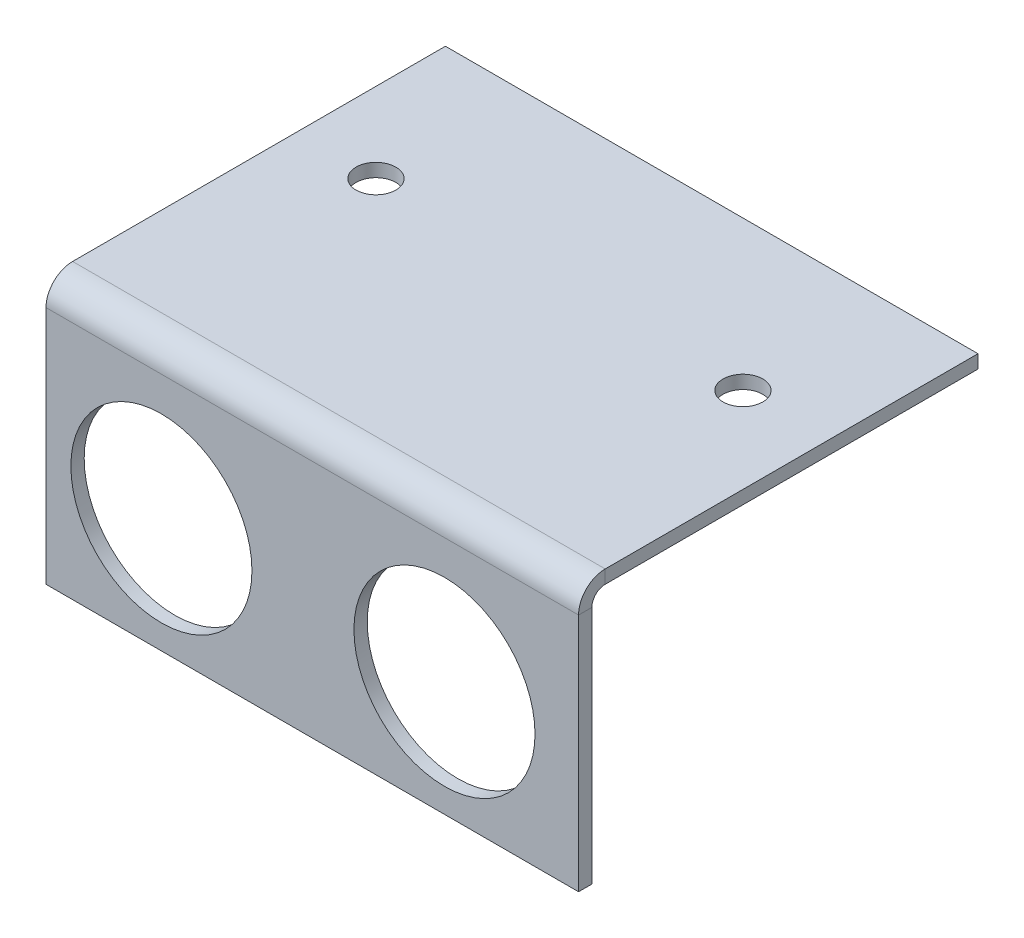
ISO-10303-21;
HEADER;
FILE_DESCRIPTION(('STEP AP214'),'2;1');
FILE_NAME('part.step','',(''),(''),'','','');
FILE_SCHEMA(('AUTOMOTIVE_DESIGN { 1 0 10303 214 1 1 1 1 }'));
ENDSEC;
DATA;
#1=APPLICATION_CONTEXT('core data for automotive mechanical design processes');
#2=APPLICATION_PROTOCOL_DEFINITION('international standard','automotive_design',2000,#1);
#3=PRODUCT_CONTEXT('',#1,'mechanical');
#4=PRODUCT('Part','Part','',(#3));
#5=PRODUCT_RELATED_PRODUCT_CATEGORY('part','',(#4));
#6=PRODUCT_DEFINITION_FORMATION('','',#4);
#7=PRODUCT_DEFINITION_CONTEXT('part definition',#1,'design');
#8=PRODUCT_DEFINITION('design','',#6,#7);
#9=PRODUCT_DEFINITION_SHAPE('','',#8);
#10=(LENGTH_UNIT() NAMED_UNIT(*) SI_UNIT(.MILLI.,.METRE.));
#11=(NAMED_UNIT(*) PLANE_ANGLE_UNIT() SI_UNIT($,.RADIAN.));
#12=(NAMED_UNIT(*) SI_UNIT($,.STERADIAN.) SOLID_ANGLE_UNIT());
#13=UNCERTAINTY_MEASURE_WITH_UNIT(LENGTH_MEASURE(1.E-05),#10,'distance_accuracy_value','');
#14=(GEOMETRIC_REPRESENTATION_CONTEXT(3) GLOBAL_UNCERTAINTY_ASSIGNED_CONTEXT((#13)) GLOBAL_UNIT_ASSIGNED_CONTEXT((#10,
#11,#12)) REPRESENTATION_CONTEXT('',''));
#15=CARTESIAN_POINT('',(0.,0.,0.));
#16=DIRECTION('',(0.,0.,1.));
#17=DIRECTION('',(1.,0.,0.));
#18=AXIS2_PLACEMENT_3D('',#15,#16,#17);
#19=CARTESIAN_POINT('',(-25.0613809960493,-3.6117945370641,-63.543927144697));
#20=DIRECTION('',(-1.,0.,0.));
#21=DIRECTION('',(0.,1.,0.));
#22=AXIS2_PLACEMENT_3D('',#19,#20,#21);
#23=PLANE('',#22);
#24=DIRECTION('',(0.,0.,-1.));
#25=VECTOR('',#24,1.);
#26=CARTESIAN_POINT('',(-25.0613809960493,19.2482054629359,-63.543927144697));
#27=LINE('',#26,#25);
#28=CARTESIAN_POINT('',(-25.0613809960493,19.2482054629359,-62.273927144697));
#29=VERTEX_POINT('',#28);
#30=CARTESIAN_POINT('',(-25.0613809960493,19.2482054629359,-63.543927144697));
#31=VERTEX_POINT('',#30);
#32=EDGE_CURVE('E11',#29,#31,#27,.T.);
#33=ORIENTED_EDGE('',*,*,#32,.F.);
#34=DIRECTION('',(0.,1.,0.));
#35=VECTOR('',#34,1.);
#36=CARTESIAN_POINT('',(-25.0613809960493,-3.6117945370641,-62.273927144697));
#37=LINE('',#36,#35);
#38=CARTESIAN_POINT('',(-25.0613809960493,-3.6117945370641,-62.273927144697));
#39=VERTEX_POINT('',#38);
#40=EDGE_CURVE('E89',#39,#29,#37,.T.);
#41=ORIENTED_EDGE('',*,*,#40,.F.);
#42=DIRECTION('',(0.,0.,-1.));
#43=VECTOR('',#42,1.);
#44=CARTESIAN_POINT('',(-25.0613809960493,-3.6117945370641,-63.543927144697));
#45=LINE('',#44,#43);
#46=CARTESIAN_POINT('',(-25.0613809960493,-3.6117945370641,-63.543927144697));
#47=VERTEX_POINT('',#46);
#48=EDGE_CURVE('E49',#39,#47,#45,.T.);
#49=ORIENTED_EDGE('',*,*,#48,.T.);
#50=DIRECTION('',(0.,1.,0.));
#51=VECTOR('',#50,1.);
#52=CARTESIAN_POINT('',(-25.0613809960493,-3.6117945370641,-63.543927144697));
#53=LINE('',#52,#51);
#54=EDGE_CURVE('E92',#47,#31,#53,.T.);
#55=ORIENTED_EDGE('',*,*,#54,.T.);
#56=EDGE_LOOP('',(#33,#41,#49,#55));
#57=FACE_BOUND('',#56,.T.);
#58=ADVANCED_FACE('F39',(#57),#23,.F.);
#59=CARTESIAN_POINT('',(-75.8613809960492,-3.6117945370641,-63.543927144697));
#60=DIRECTION('',(0.,1.,0.));
#61=DIRECTION('',(1.,0.,0.));
#62=AXIS2_PLACEMENT_3D('',#59,#60,#61);
#63=PLANE('',#62);
#64=ORIENTED_EDGE('',*,*,#48,.F.);
#65=DIRECTION('',(-1.,0.,0.));
#66=VECTOR('',#65,1.);
#67=CARTESIAN_POINT('',(-75.8613809960492,-3.6117945370641,-62.273927144697));
#68=LINE('',#67,#66);
#69=CARTESIAN_POINT('',(-75.8613809960492,-3.6117945370641,-62.273927144697));
#70=VERTEX_POINT('',#69);
#71=EDGE_CURVE('E117',#70,#39,#68,.F.);
#72=ORIENTED_EDGE('',*,*,#71,.F.);
#73=DIRECTION('',(0.,0.,-1.));
#74=VECTOR('',#73,1.);
#75=CARTESIAN_POINT('',(-75.8613809960492,-3.6117945370641,-63.543927144697));
#76=LINE('',#75,#74);
#77=CARTESIAN_POINT('',(-75.8613809960492,-3.6117945370641,-63.543927144697));
#78=VERTEX_POINT('',#77);
#79=EDGE_CURVE('E146',#70,#78,#76,.T.);
#80=ORIENTED_EDGE('',*,*,#79,.T.);
#81=DIRECTION('',(1.,0.,0.));
#82=VECTOR('',#81,1.);
#83=CARTESIAN_POINT('',(-75.8613809960492,-3.6117945370641,-63.543927144697));
#84=LINE('',#83,#82);
#85=EDGE_CURVE('E157',#78,#47,#84,.T.);
#86=ORIENTED_EDGE('',*,*,#85,.T.);
#87=EDGE_LOOP('',(#64,#72,#80,#86));
#88=FACE_BOUND('',#87,.T.);
#89=ADVANCED_FACE('F163',(#88),#63,.F.);
#90=CARTESIAN_POINT('',(-75.8613809960492,-3.6117945370641,-63.543927144697));
#91=DIRECTION('',(-1.,0.,0.));
#92=DIRECTION('',(0.,1.,0.));
#93=AXIS2_PLACEMENT_3D('',#90,#91,#92);
#94=PLANE('',#93);
#95=ORIENTED_EDGE('',*,*,#79,.F.);
#96=DIRECTION('',(0.,1.,0.));
#97=VECTOR('',#96,1.);
#98=CARTESIAN_POINT('',(-75.8613809960492,-3.6117945370641,-62.273927144697));
#99=LINE('',#98,#97);
#100=CARTESIAN_POINT('',(-75.8613809960492,19.2482054629359,-62.273927144697));
#101=VERTEX_POINT('',#100);
#102=EDGE_CURVE('E192',#70,#101,#99,.T.);
#103=ORIENTED_EDGE('',*,*,#102,.T.);
#104=DIRECTION('',(0.,0.,-1.));
#105=VECTOR('',#104,1.);
#106=CARTESIAN_POINT('',(-75.8613809960492,19.2482054629359,-63.543927144697));
#107=LINE('',#106,#105);
#108=CARTESIAN_POINT('',(-75.8613809960492,19.2482054629359,-63.543927144697));
#109=VERTEX_POINT('',#108);
#110=EDGE_CURVE('E143',#101,#109,#107,.T.);
#111=ORIENTED_EDGE('',*,*,#110,.T.);
#112=DIRECTION('',(0.,1.,0.));
#113=VECTOR('',#112,1.);
#114=CARTESIAN_POINT('',(-75.8613809960492,-3.6117945370641,-63.543927144697));
#115=LINE('',#114,#113);
#116=EDGE_CURVE('E164',#78,#109,#115,.T.);
#117=ORIENTED_EDGE('',*,*,#116,.F.);
#118=EDGE_LOOP('',(#95,#103,#111,#117));
#119=FACE_BOUND('',#118,.T.);
#120=ADVANCED_FACE('F198',(#119),#94,.T.);
#121=CARTESIAN_POINT('',(-75.8613809960492,19.2482054629359,-64.813927144697));
#122=DIRECTION('',(-1.,0.,0.));
#123=DIRECTION('',(0.,0.,1.));
#124=AXIS2_PLACEMENT_3D('',#121,#122,#123);
#125=PLANE('',#124);
#126=ORIENTED_EDGE('',*,*,#110,.F.);
#127=CARTESIAN_POINT('',(-75.8613809960492,19.2482054629359,-64.813927144697));
#128=DIRECTION('',(-1.,0.,0.));
#129=DIRECTION('',(0.,0.,1.));
#130=AXIS2_PLACEMENT_3D('',#127,#128,#129);
#131=CIRCLE('',#130,2.54);
#132=CARTESIAN_POINT('',(-75.8613809960492,21.7882054629359,-64.813927144697));
#133=VERTEX_POINT('',#132);
#134=EDGE_CURVE('E107',#101,#133,#131,.T.);
#135=ORIENTED_EDGE('',*,*,#134,.T.);
#136=DIRECTION('',(0.,-1.,0.));
#137=VECTOR('',#136,1.);
#138=CARTESIAN_POINT('',(-75.8613809960492,20.5182054629359,-64.813927144697));
#139=LINE('',#138,#137);
#140=CARTESIAN_POINT('',(-75.8613809960492,20.5182054629359,-64.813927144697));
#141=VERTEX_POINT('',#140);
#142=EDGE_CURVE('E57',#133,#141,#139,.T.);
#143=ORIENTED_EDGE('',*,*,#142,.T.);
#144=CARTESIAN_POINT('',(-75.8613809960492,19.2482054629359,-64.813927144697));
#145=DIRECTION('',(1.,0.,0.));
#146=DIRECTION('',(0.,0.,-1.));
#147=AXIS2_PLACEMENT_3D('',#144,#145,#146);
#148=CIRCLE('',#147,1.27);
#149=EDGE_CURVE('E184',#109,#141,#148,.F.);
#150=ORIENTED_EDGE('',*,*,#149,.F.);
#151=EDGE_LOOP('',(#126,#135,#143,#150));
#152=FACE_BOUND('',#151,.T.);
#153=ADVANCED_FACE('F201',(#152),#125,.T.);
#154=CARTESIAN_POINT('',(-75.8613809960492,20.5182054629359,-63.543927144697));
#155=DIRECTION('',(-1.,0.,0.));
#156=DIRECTION('',(0.,0.,-1.));
#157=AXIS2_PLACEMENT_3D('',#154,#155,#156);
#158=PLANE('',#157);
#159=ORIENTED_EDGE('',*,*,#142,.F.);
#160=DIRECTION('',(0.,0.,-1.));
#161=VECTOR('',#160,1.);
#162=CARTESIAN_POINT('',(-75.8613809960492,21.7882054629359,-63.543927144697));
#163=LINE('',#162,#161);
#164=CARTESIAN_POINT('',(-75.8613809960492,21.7882054629359,-100.373927144697));
#165=VERTEX_POINT('',#164);
#166=EDGE_CURVE('E191',#133,#165,#163,.T.);
#167=ORIENTED_EDGE('',*,*,#166,.T.);
#168=DIRECTION('',(0.,-1.,0.));
#169=VECTOR('',#168,1.);
#170=CARTESIAN_POINT('',(-75.8613809960492,20.5182054629359,-100.373927144697));
#171=LINE('',#170,#169);
#172=CARTESIAN_POINT('',(-75.8613809960492,20.5182054629359,-100.373927144697));
#173=VERTEX_POINT('',#172);
#174=EDGE_CURVE('E139',#165,#173,#171,.T.);
#175=ORIENTED_EDGE('',*,*,#174,.T.);
#176=DIRECTION('',(0.,0.,-1.));
#177=VECTOR('',#176,1.);
#178=CARTESIAN_POINT('',(-75.8613809960492,20.5182054629359,-63.543927144697));
#179=LINE('',#178,#177);
#180=EDGE_CURVE('E172',#141,#173,#179,.T.);
#181=ORIENTED_EDGE('',*,*,#180,.F.);
#182=EDGE_LOOP('',(#159,#167,#175,#181));
#183=FACE_BOUND('',#182,.T.);
#184=ADVANCED_FACE('F211',(#183),#158,.T.);
#185=CARTESIAN_POINT('',(-75.8613809960492,20.5182054629359,-100.373927144697));
#186=DIRECTION('',(0.,0.,-1.));
#187=DIRECTION('',(1.,0.,0.));
#188=AXIS2_PLACEMENT_3D('',#185,#186,#187);
#189=PLANE('',#188);
#190=ORIENTED_EDGE('',*,*,#174,.F.);
#191=DIRECTION('',(1.,0.,0.));
#192=VECTOR('',#191,1.);
#193=CARTESIAN_POINT('',(-75.8613809960492,21.7882054629359,-100.373927144697));
#194=LINE('',#193,#192);
#195=CARTESIAN_POINT('',(-25.0613809960493,21.7882054629359,-100.373927144697));
#196=VERTEX_POINT('',#195);
#197=EDGE_CURVE('E112',#165,#196,#194,.T.);
#198=ORIENTED_EDGE('',*,*,#197,.T.);
#199=DIRECTION('',(0.,-1.,0.));
#200=VECTOR('',#199,1.);
#201=CARTESIAN_POINT('',(-25.0613809960493,20.5182054629359,-100.373927144697));
#202=LINE('',#201,#200);
#203=CARTESIAN_POINT('',(-25.0613809960493,20.5182054629359,-100.373927144697));
#204=VERTEX_POINT('',#203);
#205=EDGE_CURVE('E136',#196,#204,#202,.T.);
#206=ORIENTED_EDGE('',*,*,#205,.T.);
#207=DIRECTION('',(1.,0.,0.));
#208=VECTOR('',#207,1.);
#209=CARTESIAN_POINT('',(-75.8613809960492,20.5182054629359,-100.373927144697));
#210=LINE('',#209,#208);
#211=EDGE_CURVE('E175',#173,#204,#210,.T.);
#212=ORIENTED_EDGE('',*,*,#211,.F.);
#213=EDGE_LOOP('',(#190,#198,#206,#212));
#214=FACE_BOUND('',#213,.T.);
#215=ADVANCED_FACE('F219',(#214),#189,.T.);
#216=CARTESIAN_POINT('',(-25.0613809960493,20.5182054629359,-63.543927144697));
#217=DIRECTION('',(-1.,0.,0.));
#218=DIRECTION('',(0.,0.,-1.));
#219=AXIS2_PLACEMENT_3D('',#216,#217,#218);
#220=PLANE('',#219);
#221=ORIENTED_EDGE('',*,*,#205,.F.);
#222=DIRECTION('',(0.,0.,-1.));
#223=VECTOR('',#222,1.);
#224=CARTESIAN_POINT('',(-25.0613809960493,21.7882054629359,-63.543927144697));
#225=LINE('',#224,#223);
#226=CARTESIAN_POINT('',(-25.0613809960493,21.7882054629359,-64.813927144697));
#227=VERTEX_POINT('',#226);
#228=EDGE_CURVE('E188',#227,#196,#225,.T.);
#229=ORIENTED_EDGE('',*,*,#228,.F.);
#230=DIRECTION('',(0.,-1.,0.));
#231=VECTOR('',#230,1.);
#232=CARTESIAN_POINT('',(-25.0613809960493,20.5182054629359,-64.813927144697));
#233=LINE('',#232,#231);
#234=CARTESIAN_POINT('',(-25.0613809960493,20.5182054629359,-64.813927144697));
#235=VERTEX_POINT('',#234);
#236=EDGE_CURVE('E43',#227,#235,#233,.T.);
#237=ORIENTED_EDGE('',*,*,#236,.T.);
#238=DIRECTION('',(0.,0.,-1.));
#239=VECTOR('',#238,1.);
#240=CARTESIAN_POINT('',(-25.0613809960493,20.5182054629359,-63.543927144697));
#241=LINE('',#240,#239);
#242=EDGE_CURVE('E166',#235,#204,#241,.T.);
#243=ORIENTED_EDGE('',*,*,#242,.T.);
#244=EDGE_LOOP('',(#221,#229,#237,#243));
#245=FACE_BOUND('',#244,.T.);
#246=ADVANCED_FACE('F221',(#245),#220,.F.);
#247=CARTESIAN_POINT('',(-37.852637296222,7.33859011790811,-63.543927144697));
#248=DIRECTION('',(0.,0.,-1.));
#249=DIRECTION('',(-1.,0.,0.));
#250=AXIS2_PLACEMENT_3D('',#247,#248,#249);
#251=CYLINDRICAL_SURFACE('',#250,8.636);
#252=CARTESIAN_POINT('',(-37.852637296222,7.33859011790811,-63.543927144697));
#253=DIRECTION('',(0.,0.,-1.));
#254=DIRECTION('',(-1.,0.,0.));
#255=AXIS2_PLACEMENT_3D('',#252,#253,#254);
#256=CIRCLE('',#255,8.636);
#257=CARTESIAN_POINT('',(-46.488637296222,7.33859011790811,-63.543927144697));
#258=VERTEX_POINT('',#257);
#259=EDGE_CURVE('E186',#258,#258,#256,.T.);
#260=ORIENTED_EDGE('',*,*,#259,.T.);
#261=EDGE_LOOP('',(#260));
#262=FACE_BOUND('',#261,.T.);
#263=CARTESIAN_POINT('',(-37.852637296222,7.33859011790811,-62.273927144697));
#264=DIRECTION('',(0.,0.,-1.));
#265=DIRECTION('',(-1.,0.,0.));
#266=AXIS2_PLACEMENT_3D('',#263,#264,#265);
#267=CIRCLE('',#266,8.636);
#268=CARTESIAN_POINT('',(-46.488637296222,7.33859011790811,-62.273927144697));
#269=VERTEX_POINT('',#268);
#270=EDGE_CURVE('E125',#269,#269,#267,.T.);
#271=ORIENTED_EDGE('',*,*,#270,.F.);
#272=EDGE_LOOP('',(#271));
#273=FACE_BOUND('',#272,.T.);
#274=ADVANCED_FACE('F245',(#262,#273),#251,.F.);
#275=CARTESIAN_POINT('',(-64.852637296222,7.33859011790812,-63.543927144697));
#276=DIRECTION('',(0.,0.,-1.));
#277=DIRECTION('',(-1.,0.,0.));
#278=AXIS2_PLACEMENT_3D('',#275,#276,#277);
#279=CYLINDRICAL_SURFACE('',#278,8.636);
#280=CARTESIAN_POINT('',(-64.852637296222,7.33859011790812,-63.543927144697));
#281=DIRECTION('',(0.,0.,-1.));
#282=DIRECTION('',(-1.,0.,0.));
#283=AXIS2_PLACEMENT_3D('',#280,#281,#282);
#284=CIRCLE('',#283,8.636);
#285=CARTESIAN_POINT('',(-73.488637296222,7.33859011790812,-63.543927144697));
#286=VERTEX_POINT('',#285);
#287=EDGE_CURVE('E161',#286,#286,#284,.T.);
#288=ORIENTED_EDGE('',*,*,#287,.T.);
#289=EDGE_LOOP('',(#288));
#290=FACE_BOUND('',#289,.T.);
#291=CARTESIAN_POINT('',(-64.852637296222,7.33859011790812,-62.273927144697));
#292=DIRECTION('',(0.,0.,-1.));
#293=DIRECTION('',(-1.,0.,0.));
#294=AXIS2_PLACEMENT_3D('',#291,#292,#293);
#295=CIRCLE('',#294,8.636);
#296=CARTESIAN_POINT('',(-73.488637296222,7.33859011790812,-62.273927144697));
#297=VERTEX_POINT('',#296);
#298=EDGE_CURVE('E118',#297,#297,#295,.T.);
#299=ORIENTED_EDGE('',*,*,#298,.F.);
#300=EDGE_LOOP('',(#299));
#301=FACE_BOUND('',#300,.T.);
#302=ADVANCED_FACE('F41',(#290,#301),#279,.F.);
#303=CARTESIAN_POINT('',(-25.0613809960493,19.2482054629359,-64.813927144697));
#304=DIRECTION('',(1.,0.,0.));
#305=DIRECTION('',(0.,0.,-1.));
#306=AXIS2_PLACEMENT_3D('',#303,#304,#305);
#307=PLANE('',#306);
#308=CARTESIAN_POINT('',(-25.0613809960493,19.2482054629359,-64.813927144697));
#309=DIRECTION('',(-1.,0.,0.));
#310=DIRECTION('',(0.,0.,1.));
#311=AXIS2_PLACEMENT_3D('',#308,#309,#310);
#312=CIRCLE('',#311,2.54);
#313=EDGE_CURVE('E105',#227,#29,#312,.F.);
#314=ORIENTED_EDGE('',*,*,#313,.T.);
#315=ORIENTED_EDGE('',*,*,#32,.T.);
#316=CARTESIAN_POINT('',(-25.0613809960493,19.2482054629359,-64.813927144697));
#317=DIRECTION('',(-1.,0.,0.));
#318=DIRECTION('',(0.,0.,1.));
#319=AXIS2_PLACEMENT_3D('',#316,#317,#318);
#320=CIRCLE('',#319,1.27);
#321=EDGE_CURVE('E182',#235,#31,#320,.F.);
#322=ORIENTED_EDGE('',*,*,#321,.F.);
#323=ORIENTED_EDGE('',*,*,#236,.F.);
#324=EDGE_LOOP('',(#314,#315,#322,#323));
#325=FACE_BOUND('',#324,.T.);
#326=ADVANCED_FACE('F121',(#325),#307,.T.);
#327=CARTESIAN_POINT('',(-75.8613809960492,20.5182054629359,-63.543927144697));
#328=DIRECTION('',(0.,-1.,0.));
#329=DIRECTION('',(0.,0.,-1.));
#330=AXIS2_PLACEMENT_3D('',#327,#328,#329);
#331=PLANE('',#330);
#332=CARTESIAN_POINT('',(-33.2366463921909,20.5182054629359,-86.1267751885231));
#333=DIRECTION('',(0.,-1.,0.));
#334=DIRECTION('',(0.,0.,-1.));
#335=AXIS2_PLACEMENT_3D('',#332,#333,#334);
#336=CIRCLE('',#335,1.89865);
#337=CARTESIAN_POINT('',(-33.2366463921909,20.5182054629359,-88.0254251885231));
#338=VERTEX_POINT('',#337);
#339=EDGE_CURVE('E268',#338,#338,#336,.T.);
#340=ORIENTED_EDGE('',*,*,#339,.F.);
#341=EDGE_LOOP('',(#340));
#342=FACE_BOUND('',#341,.T.);
#343=CARTESIAN_POINT('',(-68.2413809960492,20.5182054629359,-86.1267751885232));
#344=DIRECTION('',(0.,-1.,0.));
#345=DIRECTION('',(0.,0.,-1.));
#346=AXIS2_PLACEMENT_3D('',#343,#344,#345);
#347=CIRCLE('',#346,1.89865000000001);
#348=CARTESIAN_POINT('',(-68.2413809960492,20.5182054629359,-88.0254251885232));
#349=VERTEX_POINT('',#348);
#350=EDGE_CURVE('E128',#349,#349,#347,.T.);
#351=ORIENTED_EDGE('',*,*,#350,.F.);
#352=EDGE_LOOP('',(#351));
#353=FACE_BOUND('',#352,.T.);
#354=ORIENTED_EDGE('',*,*,#242,.F.);
#355=DIRECTION('',(1.,0.,0.));
#356=VECTOR('',#355,1.);
#357=CARTESIAN_POINT('',(-75.8613809960492,20.5182054629359,-64.813927144697));
#358=LINE('',#357,#356);
#359=EDGE_CURVE('E179',#235,#141,#358,.F.);
#360=ORIENTED_EDGE('',*,*,#359,.T.);
#361=ORIENTED_EDGE('',*,*,#180,.T.);
#362=ORIENTED_EDGE('',*,*,#211,.T.);
#363=EDGE_LOOP('',(#354,#360,#361,#362));
#364=FACE_BOUND('',#363,.T.);
#365=ADVANCED_FACE('F218',(#342,#353,#364),#331,.T.);
#366=CARTESIAN_POINT('',(-75.8613809960492,-3.6117945370641,-63.543927144697));
#367=DIRECTION('',(0.,0.,-1.));
#368=DIRECTION('',(-1.,0.,0.));
#369=AXIS2_PLACEMENT_3D('',#366,#367,#368);
#370=PLANE('',#369);
#371=ORIENTED_EDGE('',*,*,#259,.F.);
#372=EDGE_LOOP('',(#371));
#373=FACE_BOUND('',#372,.T.);
#374=ORIENTED_EDGE('',*,*,#287,.F.);
#375=EDGE_LOOP('',(#374));
#376=FACE_BOUND('',#375,.T.);
#377=ORIENTED_EDGE('',*,*,#116,.T.);
#378=DIRECTION('',(1.,0.,0.));
#379=VECTOR('',#378,1.);
#380=CARTESIAN_POINT('',(-25.0613809960493,19.2482054629359,-63.543927144697));
#381=LINE('',#380,#379);
#382=EDGE_CURVE('E160',#109,#31,#381,.T.);
#383=ORIENTED_EDGE('',*,*,#382,.T.);
#384=ORIENTED_EDGE('',*,*,#54,.F.);
#385=ORIENTED_EDGE('',*,*,#85,.F.);
#386=EDGE_LOOP('',(#377,#383,#384,#385));
#387=FACE_BOUND('',#386,.T.);
#388=ADVANCED_FACE('F156',(#373,#376,#387),#370,.T.);
#389=CARTESIAN_POINT('',(-75.8613809960492,19.2482054629359,-64.813927144697));
#390=DIRECTION('',(-1.,0.,0.));
#391=DIRECTION('',(0.,0.,1.));
#392=AXIS2_PLACEMENT_3D('',#389,#390,#391);
#393=CYLINDRICAL_SURFACE('',#392,1.27);
#394=ORIENTED_EDGE('',*,*,#149,.T.);
#395=ORIENTED_EDGE('',*,*,#359,.F.);
#396=ORIENTED_EDGE('',*,*,#321,.T.);
#397=ORIENTED_EDGE('',*,*,#382,.F.);
#398=EDGE_LOOP('',(#394,#395,#396,#397));
#399=FACE_BOUND('',#398,.T.);
#400=ADVANCED_FACE('F205',(#399),#393,.F.);
#401=CARTESIAN_POINT('',(-75.8613809960492,21.7882054629359,-63.543927144697));
#402=DIRECTION('',(0.,-1.,0.));
#403=DIRECTION('',(0.,0.,-1.));
#404=AXIS2_PLACEMENT_3D('',#401,#402,#403);
#405=PLANE('',#404);
#406=CARTESIAN_POINT('',(-33.2366463921909,21.7882054629359,-86.1267751885231));
#407=DIRECTION('',(0.,-1.,0.));
#408=DIRECTION('',(0.,0.,-1.));
#409=AXIS2_PLACEMENT_3D('',#406,#407,#408);
#410=CIRCLE('',#409,1.89865);
#411=CARTESIAN_POINT('',(-33.2366463921909,21.7882054629359,-88.0254251885231));
#412=VERTEX_POINT('',#411);
#413=EDGE_CURVE('E266',#412,#412,#410,.T.);
#414=ORIENTED_EDGE('',*,*,#413,.T.);
#415=EDGE_LOOP('',(#414));
#416=FACE_BOUND('',#415,.T.);
#417=CARTESIAN_POINT('',(-68.2413809960492,21.7882054629359,-86.1267751885232));
#418=DIRECTION('',(0.,-1.,0.));
#419=DIRECTION('',(0.,0.,-1.));
#420=AXIS2_PLACEMENT_3D('',#417,#418,#419);
#421=CIRCLE('',#420,1.89865000000001);
#422=CARTESIAN_POINT('',(-68.2413809960492,21.7882054629359,-88.0254251885232));
#423=VERTEX_POINT('',#422);
#424=EDGE_CURVE('E123',#423,#423,#421,.T.);
#425=ORIENTED_EDGE('',*,*,#424,.T.);
#426=EDGE_LOOP('',(#425));
#427=FACE_BOUND('',#426,.T.);
#428=ORIENTED_EDGE('',*,*,#228,.T.);
#429=ORIENTED_EDGE('',*,*,#197,.F.);
#430=ORIENTED_EDGE('',*,*,#166,.F.);
#431=DIRECTION('',(1.,0.,0.));
#432=VECTOR('',#431,1.);
#433=CARTESIAN_POINT('',(-75.8613809960492,21.7882054629359,-64.813927144697));
#434=LINE('',#433,#432);
#435=EDGE_CURVE('E111',#227,#133,#434,.F.);
#436=ORIENTED_EDGE('',*,*,#435,.F.);
#437=EDGE_LOOP('',(#428,#429,#430,#436));
#438=FACE_BOUND('',#437,.T.);
#439=ADVANCED_FACE('F223',(#416,#427,#438),#405,.F.);
#440=CARTESIAN_POINT('',(-75.8613809960492,-3.6117945370641,-62.273927144697));
#441=DIRECTION('',(0.,0.,-1.));
#442=DIRECTION('',(-1.,0.,0.));
#443=AXIS2_PLACEMENT_3D('',#440,#441,#442);
#444=PLANE('',#443);
#445=ORIENTED_EDGE('',*,*,#270,.T.);
#446=EDGE_LOOP('',(#445));
#447=FACE_BOUND('',#446,.T.);
#448=ORIENTED_EDGE('',*,*,#298,.T.);
#449=EDGE_LOOP('',(#448));
#450=FACE_BOUND('',#449,.T.);
#451=ORIENTED_EDGE('',*,*,#102,.F.);
#452=ORIENTED_EDGE('',*,*,#71,.T.);
#453=ORIENTED_EDGE('',*,*,#40,.T.);
#454=DIRECTION('',(-1.,0.,0.));
#455=VECTOR('',#454,1.);
#456=CARTESIAN_POINT('',(-75.8613809960492,19.2482054629359,-62.273927144697));
#457=LINE('',#456,#455);
#458=EDGE_CURVE('E102',#101,#29,#457,.F.);
#459=ORIENTED_EDGE('',*,*,#458,.F.);
#460=EDGE_LOOP('',(#451,#452,#453,#459));
#461=FACE_BOUND('',#460,.T.);
#462=ADVANCED_FACE('F115',(#447,#450,#461),#444,.F.);
#463=CARTESIAN_POINT('',(-75.8613809960492,19.2482054629359,-64.813927144697));
#464=DIRECTION('',(-1.,0.,0.));
#465=DIRECTION('',(0.,0.,1.));
#466=AXIS2_PLACEMENT_3D('',#463,#464,#465);
#467=CYLINDRICAL_SURFACE('',#466,2.54);
#468=ORIENTED_EDGE('',*,*,#134,.F.);
#469=ORIENTED_EDGE('',*,*,#458,.T.);
#470=ORIENTED_EDGE('',*,*,#313,.F.);
#471=ORIENTED_EDGE('',*,*,#435,.T.);
#472=EDGE_LOOP('',(#468,#469,#470,#471));
#473=FACE_BOUND('',#472,.T.);
#474=ADVANCED_FACE('F103',(#473),#467,.T.);
#475=CARTESIAN_POINT('',(-68.2413809960492,21.7882054629359,-86.1267751885232));
#476=DIRECTION('',(0.,-1.,0.));
#477=DIRECTION('',(0.,0.,-1.));
#478=AXIS2_PLACEMENT_3D('',#475,#476,#477);
#479=CYLINDRICAL_SURFACE('',#478,1.89865000000001);
#480=ORIENTED_EDGE('',*,*,#424,.F.);
#481=EDGE_LOOP('',(#480));
#482=FACE_BOUND('',#481,.T.);
#483=ORIENTED_EDGE('',*,*,#350,.T.);
#484=EDGE_LOOP('',(#483));
#485=FACE_BOUND('',#484,.T.);
#486=ADVANCED_FACE('F276',(#482,#485),#479,.F.);
#487=CARTESIAN_POINT('',(-33.2366463921909,21.7882054629359,-86.1267751885231));
#488=DIRECTION('',(0.,-1.,0.));
#489=DIRECTION('',(0.,0.,-1.));
#490=AXIS2_PLACEMENT_3D('',#487,#488,#489);
#491=CYLINDRICAL_SURFACE('',#490,1.89865);
#492=ORIENTED_EDGE('',*,*,#413,.F.);
#493=EDGE_LOOP('',(#492));
#494=FACE_BOUND('',#493,.T.);
#495=ORIENTED_EDGE('',*,*,#339,.T.);
#496=EDGE_LOOP('',(#495));
#497=FACE_BOUND('',#496,.T.);
#498=ADVANCED_FACE('F273',(#494,#497),#491,.F.);
#499=CLOSED_SHELL('',(#58,#89,#120,#153,#184,#215,#246,#274,#302,#326,#365,#388,#400,#439,#462,
#474,#486,#498));
#500=MANIFOLD_SOLID_BREP('B2',#499);
#501=ADVANCED_BREP_SHAPE_REPRESENTATION('',(#18,#500),#14);
#502=SHAPE_DEFINITION_REPRESENTATION(#9,#501);
ENDSEC;
END-ISO-10303-21;
